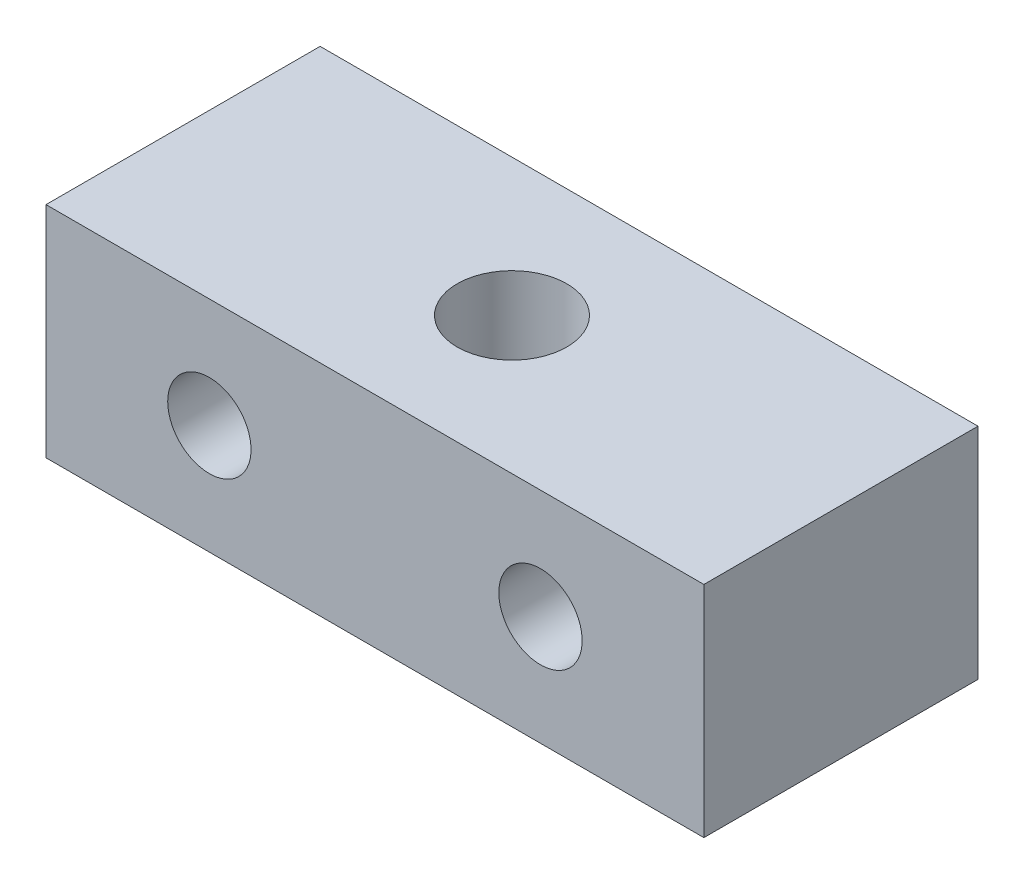
ISO-10303-21;
HEADER;
FILE_DESCRIPTION(('STEP AP214'),'2;1');
FILE_NAME('part.step','',(''),(''),'','','');
FILE_SCHEMA(('AUTOMOTIVE_DESIGN { 1 0 10303 214 1 1 1 1 }'));
ENDSEC;
DATA;
#1=APPLICATION_CONTEXT('core data for automotive mechanical design processes');
#2=APPLICATION_PROTOCOL_DEFINITION('international standard','automotive_design',2000,#1);
#3=PRODUCT_CONTEXT('',#1,'mechanical');
#4=PRODUCT('Part','Part','',(#3));
#5=PRODUCT_RELATED_PRODUCT_CATEGORY('part','',(#4));
#6=PRODUCT_DEFINITION_FORMATION('','',#4);
#7=PRODUCT_DEFINITION_CONTEXT('part definition',#1,'design');
#8=PRODUCT_DEFINITION('design','',#6,#7);
#9=PRODUCT_DEFINITION_SHAPE('','',#8);
#10=(LENGTH_UNIT() NAMED_UNIT(*) SI_UNIT(.MILLI.,.METRE.));
#11=(NAMED_UNIT(*) PLANE_ANGLE_UNIT() SI_UNIT($,.RADIAN.));
#12=(NAMED_UNIT(*) SI_UNIT($,.STERADIAN.) SOLID_ANGLE_UNIT());
#13=UNCERTAINTY_MEASURE_WITH_UNIT(LENGTH_MEASURE(1.E-05),#10,'distance_accuracy_value','');
#14=(GEOMETRIC_REPRESENTATION_CONTEXT(3) GLOBAL_UNCERTAINTY_ASSIGNED_CONTEXT((#13)) GLOBAL_UNIT_ASSIGNED_CONTEXT((#10,
#11,#12)) REPRESENTATION_CONTEXT('',''));
#15=CARTESIAN_POINT('',(0.,0.,0.));
#16=DIRECTION('',(0.,0.,1.));
#17=DIRECTION('',(1.,0.,0.));
#18=AXIS2_PLACEMENT_3D('',#15,#16,#17);
#19=CARTESIAN_POINT('',(19.05,12.7,-7.9375));
#20=DIRECTION('',(-1.,0.,0.));
#21=DIRECTION('',(0.,0.,1.));
#22=AXIS2_PLACEMENT_3D('',#19,#20,#21);
#23=PLANE('',#22);
#24=DIRECTION('',(0.,0.,-1.));
#25=VECTOR('',#24,1.);
#26=CARTESIAN_POINT('',(19.05,0.,-7.9375));
#27=LINE('',#26,#25);
#28=CARTESIAN_POINT('',(19.05,0.,7.9375));
#29=VERTEX_POINT('',#28);
#30=CARTESIAN_POINT('',(19.05,0.,-7.9375));
#31=VERTEX_POINT('',#30);
#32=EDGE_CURVE('E109',#29,#31,#27,.T.);
#33=ORIENTED_EDGE('',*,*,#32,.T.);
#34=DIRECTION('',(0.,-1.,0.));
#35=VECTOR('',#34,1.);
#36=CARTESIAN_POINT('',(19.05,12.7,-7.9375));
#37=LINE('',#36,#35);
#38=CARTESIAN_POINT('',(19.05,12.7,-7.9375));
#39=VERTEX_POINT('',#38);
#40=EDGE_CURVE('E13',#39,#31,#37,.T.);
#41=ORIENTED_EDGE('',*,*,#40,.F.);
#42=DIRECTION('',(0.,0.,-1.));
#43=VECTOR('',#42,1.);
#44=CARTESIAN_POINT('',(19.05,12.7,-7.9375));
#45=LINE('',#44,#43);
#46=CARTESIAN_POINT('',(19.05,12.7,7.9375));
#47=VERTEX_POINT('',#46);
#48=EDGE_CURVE('E97',#47,#39,#45,.T.);
#49=ORIENTED_EDGE('',*,*,#48,.F.);
#50=DIRECTION('',(0.,-1.,0.));
#51=VECTOR('',#50,1.);
#52=CARTESIAN_POINT('',(19.05,12.7,7.9375));
#53=LINE('',#52,#51);
#54=EDGE_CURVE('E105',#47,#29,#53,.T.);
#55=ORIENTED_EDGE('',*,*,#54,.T.);
#56=EDGE_LOOP('',(#33,#41,#49,#55));
#57=FACE_BOUND('',#56,.T.);
#58=ADVANCED_FACE('F46',(#57),#23,.F.);
#59=CARTESIAN_POINT('',(-19.05,12.7,-7.9375));
#60=DIRECTION('',(0.,0.,1.));
#61=DIRECTION('',(1.,0.,0.));
#62=AXIS2_PLACEMENT_3D('',#59,#60,#61);
#63=PLANE('',#62);
#64=CARTESIAN_POINT('',(-9.5885,6.35,-7.9375));
#65=DIRECTION('',(0.,0.,-1.));
#66=DIRECTION('',(-1.,0.,0.));
#67=AXIS2_PLACEMENT_3D('',#64,#65,#66);
#68=CIRCLE('',#67,2.413);
#69=CARTESIAN_POINT('',(-12.0015,6.35,-7.9375));
#70=VERTEX_POINT('',#69);
#71=EDGE_CURVE('E129',#70,#70,#68,.T.);
#72=ORIENTED_EDGE('',*,*,#71,.F.);
#73=EDGE_LOOP('',(#72));
#74=FACE_BOUND('',#73,.T.);
#75=CARTESIAN_POINT('',(9.5885,6.35,-7.9375));
#76=DIRECTION('',(0.,0.,-1.));
#77=DIRECTION('',(-1.,0.,0.));
#78=AXIS2_PLACEMENT_3D('',#75,#76,#77);
#79=CIRCLE('',#78,2.413);
#80=CARTESIAN_POINT('',(7.1755,6.35,-7.9375));
#81=VERTEX_POINT('',#80);
#82=EDGE_CURVE('E123',#81,#81,#79,.T.);
#83=ORIENTED_EDGE('',*,*,#82,.F.);
#84=EDGE_LOOP('',(#83));
#85=FACE_BOUND('',#84,.T.);
#86=DIRECTION('',(-1.,0.,0.));
#87=VECTOR('',#86,1.);
#88=CARTESIAN_POINT('',(-19.05,0.,-7.9375));
#89=LINE('',#88,#87);
#90=CARTESIAN_POINT('',(-19.05,0.,-7.9375));
#91=VERTEX_POINT('',#90);
#92=EDGE_CURVE('E101',#31,#91,#89,.T.);
#93=ORIENTED_EDGE('',*,*,#92,.T.);
#94=DIRECTION('',(0.,-1.,0.));
#95=VECTOR('',#94,1.);
#96=CARTESIAN_POINT('',(-19.05,12.7,-7.9375));
#97=LINE('',#96,#95);
#98=CARTESIAN_POINT('',(-19.05,12.7,-7.9375));
#99=VERTEX_POINT('',#98);
#100=EDGE_CURVE('E54',#99,#91,#97,.T.);
#101=ORIENTED_EDGE('',*,*,#100,.F.);
#102=DIRECTION('',(-1.,0.,0.));
#103=VECTOR('',#102,1.);
#104=CARTESIAN_POINT('',(-19.05,12.7,-7.9375));
#105=LINE('',#104,#103);
#106=EDGE_CURVE('E92',#39,#99,#105,.T.);
#107=ORIENTED_EDGE('',*,*,#106,.F.);
#108=ORIENTED_EDGE('',*,*,#40,.T.);
#109=EDGE_LOOP('',(#93,#101,#107,#108));
#110=FACE_BOUND('',#109,.T.);
#111=ADVANCED_FACE('F100',(#74,#85,#110),#63,.F.);
#112=CARTESIAN_POINT('',(-19.05,12.7,-7.9375));
#113=DIRECTION('',(1.,0.,0.));
#114=DIRECTION('',(0.,0.,-1.));
#115=AXIS2_PLACEMENT_3D('',#112,#113,#114);
#116=PLANE('',#115);
#117=DIRECTION('',(0.,0.,1.));
#118=VECTOR('',#117,1.);
#119=CARTESIAN_POINT('',(-19.05,0.,-7.9375));
#120=LINE('',#119,#118);
#121=CARTESIAN_POINT('',(-19.05,0.,7.9375));
#122=VERTEX_POINT('',#121);
#123=EDGE_CURVE('E79',#91,#122,#120,.T.);
#124=ORIENTED_EDGE('',*,*,#123,.T.);
#125=DIRECTION('',(0.,-1.,0.));
#126=VECTOR('',#125,1.);
#127=CARTESIAN_POINT('',(-19.05,12.7,7.9375));
#128=LINE('',#127,#126);
#129=CARTESIAN_POINT('',(-19.05,12.7,7.9375));
#130=VERTEX_POINT('',#129);
#131=EDGE_CURVE('E102',#130,#122,#128,.T.);
#132=ORIENTED_EDGE('',*,*,#131,.F.);
#133=DIRECTION('',(0.,0.,1.));
#134=VECTOR('',#133,1.);
#135=CARTESIAN_POINT('',(-19.05,12.7,-7.9375));
#136=LINE('',#135,#134);
#137=EDGE_CURVE('E95',#99,#130,#136,.T.);
#138=ORIENTED_EDGE('',*,*,#137,.F.);
#139=ORIENTED_EDGE('',*,*,#100,.T.);
#140=EDGE_LOOP('',(#124,#132,#138,#139));
#141=FACE_BOUND('',#140,.T.);
#142=ADVANCED_FACE('F103',(#141),#116,.F.);
#143=CARTESIAN_POINT('',(-19.05,12.7,7.9375));
#144=DIRECTION('',(0.,0.,-1.));
#145=DIRECTION('',(-1.,0.,0.));
#146=AXIS2_PLACEMENT_3D('',#143,#144,#145);
#147=PLANE('',#146);
#148=CARTESIAN_POINT('',(-9.5885,6.35,7.9375));
#149=DIRECTION('',(0.,0.,-1.));
#150=DIRECTION('',(-1.,0.,0.));
#151=AXIS2_PLACEMENT_3D('',#148,#149,#150);
#152=CIRCLE('',#151,2.413);
#153=CARTESIAN_POINT('',(-12.0015,6.35,7.9375));
#154=VERTEX_POINT('',#153);
#155=EDGE_CURVE('E126',#154,#154,#152,.T.);
#156=ORIENTED_EDGE('',*,*,#155,.T.);
#157=EDGE_LOOP('',(#156));
#158=FACE_BOUND('',#157,.T.);
#159=CARTESIAN_POINT('',(9.5885,6.35,7.9375));
#160=DIRECTION('',(0.,0.,-1.));
#161=DIRECTION('',(-1.,0.,0.));
#162=AXIS2_PLACEMENT_3D('',#159,#160,#161);
#163=CIRCLE('',#162,2.413);
#164=CARTESIAN_POINT('',(7.1755,6.35,7.9375));
#165=VERTEX_POINT('',#164);
#166=EDGE_CURVE('E112',#165,#165,#163,.T.);
#167=ORIENTED_EDGE('',*,*,#166,.T.);
#168=EDGE_LOOP('',(#167));
#169=FACE_BOUND('',#168,.T.);
#170=DIRECTION('',(1.,0.,0.));
#171=VECTOR('',#170,1.);
#172=CARTESIAN_POINT('',(-19.05,0.,7.9375));
#173=LINE('',#172,#171);
#174=EDGE_CURVE('E85',#122,#29,#173,.T.);
#175=ORIENTED_EDGE('',*,*,#174,.T.);
#176=ORIENTED_EDGE('',*,*,#54,.F.);
#177=DIRECTION('',(1.,0.,0.));
#178=VECTOR('',#177,1.);
#179=CARTESIAN_POINT('',(-19.05,12.7,7.9375));
#180=LINE('',#179,#178);
#181=EDGE_CURVE('E62',#130,#47,#180,.T.);
#182=ORIENTED_EDGE('',*,*,#181,.F.);
#183=ORIENTED_EDGE('',*,*,#131,.T.);
#184=EDGE_LOOP('',(#175,#176,#182,#183));
#185=FACE_BOUND('',#184,.T.);
#186=ADVANCED_FACE('F117',(#158,#169,#185),#147,.F.);
#187=CARTESIAN_POINT('',(0.,12.7,0.));
#188=DIRECTION('',(0.,1.,0.));
#189=DIRECTION('',(0.,0.,1.));
#190=AXIS2_PLACEMENT_3D('',#187,#188,#189);
#191=PLANE('',#190);
#192=CARTESIAN_POINT('',(0.,12.7,0.));
#193=DIRECTION('',(0.,1.,0.));
#194=DIRECTION('',(0.,0.,1.));
#195=AXIS2_PLACEMENT_3D('',#192,#193,#194);
#196=CIRCLE('',#195,3.175);
#197=CARTESIAN_POINT('',(0.,12.7,3.175));
#198=VERTEX_POINT('',#197);
#199=EDGE_CURVE('E135',#198,#198,#196,.T.);
#200=ORIENTED_EDGE('',*,*,#199,.F.);
#201=EDGE_LOOP('',(#200));
#202=FACE_BOUND('',#201,.T.);
#203=ORIENTED_EDGE('',*,*,#48,.T.);
#204=ORIENTED_EDGE('',*,*,#106,.T.);
#205=ORIENTED_EDGE('',*,*,#137,.T.);
#206=ORIENTED_EDGE('',*,*,#181,.T.);
#207=EDGE_LOOP('',(#203,#204,#205,#206));
#208=FACE_BOUND('',#207,.T.);
#209=ADVANCED_FACE('F93',(#202,#208),#191,.T.);
#210=CARTESIAN_POINT('',(0.,0.,0.));
#211=DIRECTION('',(0.,1.,0.));
#212=DIRECTION('',(0.,0.,1.));
#213=AXIS2_PLACEMENT_3D('',#210,#211,#212);
#214=PLANE('',#213);
#215=CARTESIAN_POINT('',(0.,0.,0.));
#216=DIRECTION('',(0.,1.,0.));
#217=DIRECTION('',(0.,0.,1.));
#218=AXIS2_PLACEMENT_3D('',#215,#216,#217);
#219=CIRCLE('',#218,3.175);
#220=CARTESIAN_POINT('',(0.,0.,3.175));
#221=VERTEX_POINT('',#220);
#222=EDGE_CURVE('E132',#221,#221,#219,.T.);
#223=ORIENTED_EDGE('',*,*,#222,.T.);
#224=EDGE_LOOP('',(#223));
#225=FACE_BOUND('',#224,.T.);
#226=ORIENTED_EDGE('',*,*,#32,.F.);
#227=ORIENTED_EDGE('',*,*,#174,.F.);
#228=ORIENTED_EDGE('',*,*,#123,.F.);
#229=ORIENTED_EDGE('',*,*,#92,.F.);
#230=EDGE_LOOP('',(#226,#227,#228,#229));
#231=FACE_BOUND('',#230,.T.);
#232=ADVANCED_FACE('F120',(#225,#231),#214,.F.);
#233=CARTESIAN_POINT('',(9.5885,6.35,7.9375));
#234=DIRECTION('',(0.,0.,-1.));
#235=DIRECTION('',(-1.,0.,0.));
#236=AXIS2_PLACEMENT_3D('',#233,#234,#235);
#237=CYLINDRICAL_SURFACE('',#236,2.413);
#238=ORIENTED_EDGE('',*,*,#166,.F.);
#239=EDGE_LOOP('',(#238));
#240=FACE_BOUND('',#239,.T.);
#241=ORIENTED_EDGE('',*,*,#82,.T.);
#242=EDGE_LOOP('',(#241));
#243=FACE_BOUND('',#242,.T.);
#244=ADVANCED_FACE('F155',(#240,#243),#237,.F.);
#245=CARTESIAN_POINT('',(-9.5885,6.35,7.9375));
#246=DIRECTION('',(0.,0.,-1.));
#247=DIRECTION('',(-1.,0.,0.));
#248=AXIS2_PLACEMENT_3D('',#245,#246,#247);
#249=CYLINDRICAL_SURFACE('',#248,2.413);
#250=ORIENTED_EDGE('',*,*,#155,.F.);
#251=EDGE_LOOP('',(#250));
#252=FACE_BOUND('',#251,.T.);
#253=ORIENTED_EDGE('',*,*,#71,.T.);
#254=EDGE_LOOP('',(#253));
#255=FACE_BOUND('',#254,.T.);
#256=ADVANCED_FACE('F145',(#252,#255),#249,.F.);
#257=CARTESIAN_POINT('',(0.,0.,0.));
#258=DIRECTION('',(0.,1.,0.));
#259=DIRECTION('',(0.,0.,1.));
#260=AXIS2_PLACEMENT_3D('',#257,#258,#259);
#261=CYLINDRICAL_SURFACE('',#260,3.175);
#262=ORIENTED_EDGE('',*,*,#222,.F.);
#263=EDGE_LOOP('',(#262));
#264=FACE_BOUND('',#263,.T.);
#265=ORIENTED_EDGE('',*,*,#199,.T.);
#266=EDGE_LOOP('',(#265));
#267=FACE_BOUND('',#266,.T.);
#268=ADVANCED_FACE('F142',(#264,#267),#261,.F.);
#269=CLOSED_SHELL('',(#58,#111,#142,#186,#209,#232,#244,#256,#268));
#270=MANIFOLD_SOLID_BREP('B2',#269);
#271=ADVANCED_BREP_SHAPE_REPRESENTATION('',(#18,#270),#14);
#272=SHAPE_DEFINITION_REPRESENTATION(#9,#271);
ENDSEC;
END-ISO-10303-21;
